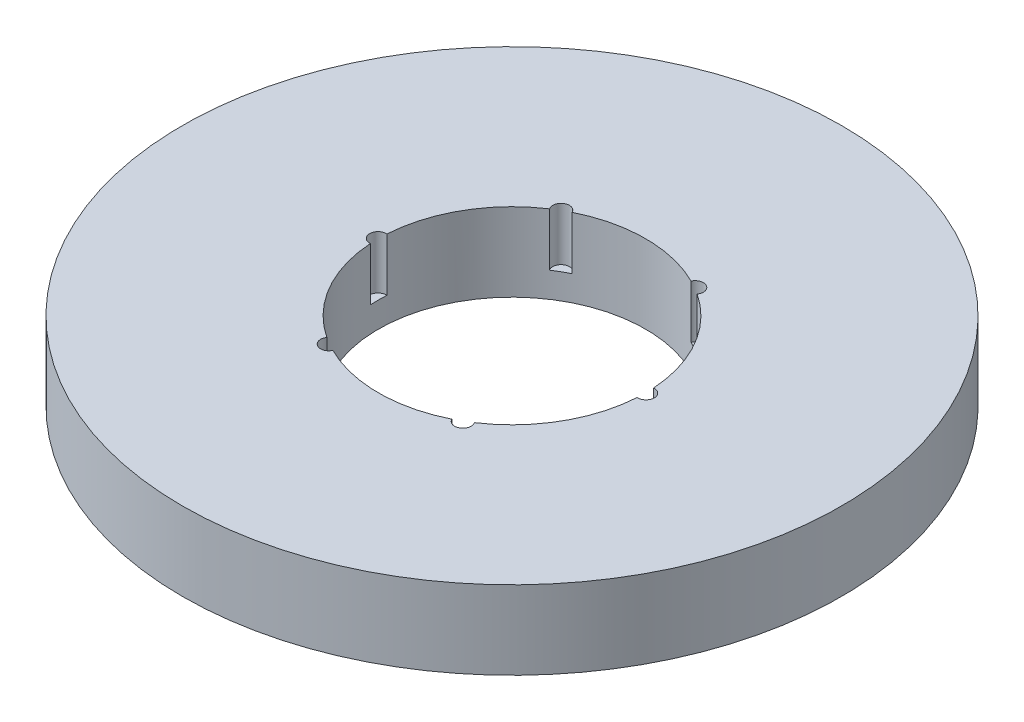
ISO-10303-21;
HEADER;
FILE_DESCRIPTION(('STEP AP214'),'2;1');
FILE_NAME('part.step','',(''),(''),'','','');
FILE_SCHEMA(('AUTOMOTIVE_DESIGN { 1 0 10303 214 1 1 1 1 }'));
ENDSEC;
DATA;
#1=APPLICATION_CONTEXT('core data for automotive mechanical design processes');
#2=APPLICATION_PROTOCOL_DEFINITION('international standard','automotive_design',2000,#1);
#3=PRODUCT_CONTEXT('',#1,'mechanical');
#4=PRODUCT('Part','Part','',(#3));
#5=PRODUCT_RELATED_PRODUCT_CATEGORY('part','',(#4));
#6=PRODUCT_DEFINITION_FORMATION('','',#4);
#7=PRODUCT_DEFINITION_CONTEXT('part definition',#1,'design');
#8=PRODUCT_DEFINITION('design','',#6,#7);
#9=PRODUCT_DEFINITION_SHAPE('','',#8);
#10=(LENGTH_UNIT() NAMED_UNIT(*) SI_UNIT(.MILLI.,.METRE.));
#11=(NAMED_UNIT(*) PLANE_ANGLE_UNIT() SI_UNIT($,.RADIAN.));
#12=(NAMED_UNIT(*) SI_UNIT($,.STERADIAN.) SOLID_ANGLE_UNIT());
#13=UNCERTAINTY_MEASURE_WITH_UNIT(LENGTH_MEASURE(1.E-05),#10,'distance_accuracy_value','');
#14=(GEOMETRIC_REPRESENTATION_CONTEXT(3) GLOBAL_UNCERTAINTY_ASSIGNED_CONTEXT((#13)) GLOBAL_UNIT_ASSIGNED_CONTEXT((#10,
#11,#12)) REPRESENTATION_CONTEXT('',''));
#15=CARTESIAN_POINT('',(0.,0.,0.));
#16=DIRECTION('',(0.,0.,1.));
#17=DIRECTION('',(1.,0.,0.));
#18=AXIS2_PLACEMENT_3D('',#15,#16,#17);
#19=CARTESIAN_POINT('',(0.,22.,0.));
#20=DIRECTION('',(0.,-1.,0.));
#21=DIRECTION('',(0.,0.,-1.));
#22=AXIS2_PLACEMENT_3D('',#19,#20,#21);
#23=CYLINDRICAL_SURFACE('',#22,92.5);
#24=CARTESIAN_POINT('',(0.,22.,0.));
#25=DIRECTION('',(0.,1.,0.));
#26=DIRECTION('',(0.,0.,1.));
#27=AXIS2_PLACEMENT_3D('',#24,#25,#26);
#28=CIRCLE('',#27,92.5);
#29=CARTESIAN_POINT('',(0.,22.,92.5));
#30=VERTEX_POINT('',#29);
#31=EDGE_CURVE('E171',#30,#30,#28,.T.);
#32=ORIENTED_EDGE('',*,*,#31,.F.);
#33=EDGE_LOOP('',(#32));
#34=FACE_BOUND('',#33,.T.);
#35=CARTESIAN_POINT('',(0.,0.,0.));
#36=DIRECTION('',(0.,1.,0.));
#37=DIRECTION('',(0.,0.,1.));
#38=AXIS2_PLACEMENT_3D('',#35,#36,#37);
#39=CIRCLE('',#38,92.5);
#40=CARTESIAN_POINT('',(0.,0.,92.5));
#41=VERTEX_POINT('',#40);
#42=EDGE_CURVE('E157',#41,#41,#39,.T.);
#43=ORIENTED_EDGE('',*,*,#42,.T.);
#44=EDGE_LOOP('',(#43));
#45=FACE_BOUND('',#44,.T.);
#46=ADVANCED_FACE('F39',(#34,#45),#23,.T.);
#47=CARTESIAN_POINT('',(0.,22.,0.));
#48=DIRECTION('',(0.,1.,0.));
#49=DIRECTION('',(0.,0.,1.));
#50=AXIS2_PLACEMENT_3D('',#47,#48,#49);
#51=PLANE('',#50);
#52=CARTESIAN_POINT('',(-18.8048842403725,22.,-32.5710149347755));
#53=DIRECTION('',(0.,1.,0.));
#54=DIRECTION('',(-0.866025403784433,0.,0.50000000000001));
#55=AXIS2_PLACEMENT_3D('',#52,#53,#54);
#56=CIRCLE('',#55,2.32921011253287);
#57=CARTESIAN_POINT('',(-16.7030116719781,22.,-33.5746839312861));
#58=VERTEX_POINT('',#57);
#59=CARTESIAN_POINT('',(-20.7250233725387,22.,-31.2525743932836));
#60=VERTEX_POINT('',#59);
#61=EDGE_CURVE('E214',#58,#60,#56,.T.);
#62=ORIENTED_EDGE('',*,*,#61,.F.);
#63=CARTESIAN_POINT('',(0.,22.,0.));
#64=DIRECTION('',(0.,1.,0.));
#65=DIRECTION('',(0.,0.,1.));
#66=AXIS2_PLACEMENT_3D('',#63,#64,#65);
#67=CIRCLE('',#66,37.5);
#68=CARTESIAN_POINT('',(16.7030116719774,22.,-33.5746839312865));
#69=VERTEX_POINT('',#68);
#70=EDGE_CURVE('E272',#69,#58,#67,.T.);
#71=ORIENTED_EDGE('',*,*,#70,.F.);
#72=CARTESIAN_POINT('',(18.8048842403718,22.,-32.5710149347759));
#73=DIRECTION('',(0.,1.,0.));
#74=DIRECTION('',(-0.866025403784443,0.,-0.499999999999992));
#75=AXIS2_PLACEMENT_3D('',#72,#73,#74);
#76=CIRCLE('',#75,2.32921011253287);
#77=CARTESIAN_POINT('',(20.725023372538,22.,-31.252574393284));
#78=VERTEX_POINT('',#77);
#79=EDGE_CURVE('E285',#78,#69,#76,.T.);
#80=ORIENTED_EDGE('',*,*,#79,.F.);
#81=CARTESIAN_POINT('',(37.428035044516,22.,-2.32210953800248));
#82=VERTEX_POINT('',#81);
#83=EDGE_CURVE('E165',#82,#78,#67,.T.);
#84=ORIENTED_EDGE('',*,*,#83,.F.);
#85=CARTESIAN_POINT('',(37.6097684807442,22.,0.));
#86=DIRECTION('',(0.,1.,0.));
#87=DIRECTION('',(0.,0.,-1.));
#88=AXIS2_PLACEMENT_3D('',#85,#86,#87);
#89=CIRCLE('',#88,2.32921011253287);
#90=CARTESIAN_POINT('',(37.428035044516,22.,2.32210953800248));
#91=VERTEX_POINT('',#90);
#92=EDGE_CURVE('E281',#91,#82,#89,.T.);
#93=ORIENTED_EDGE('',*,*,#92,.F.);
#94=CARTESIAN_POINT('',(20.7250233725384,22.,31.2525743932838));
#95=VERTEX_POINT('',#94);
#96=EDGE_CURVE('E160',#95,#91,#67,.T.);
#97=ORIENTED_EDGE('',*,*,#96,.F.);
#98=CARTESIAN_POINT('',(18.8048842403722,22.,32.5710149347756));
#99=DIRECTION('',(0.,1.,0.));
#100=DIRECTION('',(0.866025403784436,0.,-0.500000000000004));
#101=AXIS2_PLACEMENT_3D('',#98,#99,#100);
#102=CIRCLE('',#101,2.32921011253287);
#103=CARTESIAN_POINT('',(16.7030116719779,22.,33.5746839312863));
#104=VERTEX_POINT('',#103);
#105=EDGE_CURVE('E154',#104,#95,#102,.T.);
#106=ORIENTED_EDGE('',*,*,#105,.F.);
#107=CARTESIAN_POINT('',(-16.7030116719776,22.,33.5746839312864));
#108=VERTEX_POINT('',#107);
#109=EDGE_CURVE('E150',#108,#104,#67,.T.);
#110=ORIENTED_EDGE('',*,*,#109,.F.);
#111=CARTESIAN_POINT('',(-18.804884240372,22.,32.5710149347758));
#112=DIRECTION('',(0.,1.,0.));
#113=DIRECTION('',(0.86602540378444,0.,0.499999999999998));
#114=AXIS2_PLACEMENT_3D('',#111,#112,#113);
#115=CIRCLE('',#114,2.32921011253287);
#116=CARTESIAN_POINT('',(-20.7250233725382,22.,31.2525743932839));
#117=VERTEX_POINT('',#116);
#118=EDGE_CURVE('E127',#117,#108,#115,.T.);
#119=ORIENTED_EDGE('',*,*,#118,.F.);
#120=CARTESIAN_POINT('',(-37.428035044516,22.,2.32210953800248));
#121=VERTEX_POINT('',#120);
#122=EDGE_CURVE('E156',#121,#117,#67,.T.);
#123=ORIENTED_EDGE('',*,*,#122,.F.);
#124=CARTESIAN_POINT('',(-37.6097684807442,22.,0.));
#125=DIRECTION('',(0.,1.,0.));
#126=DIRECTION('',(0.,0.,1.));
#127=AXIS2_PLACEMENT_3D('',#124,#125,#126);
#128=CIRCLE('',#127,2.32921011253287);
#129=CARTESIAN_POINT('',(-37.428035044516,22.,-2.32210953800248));
#130=VERTEX_POINT('',#129);
#131=EDGE_CURVE('E164',#130,#121,#128,.T.);
#132=ORIENTED_EDGE('',*,*,#131,.F.);
#133=EDGE_CURVE('E159',#60,#130,#67,.T.);
#134=ORIENTED_EDGE('',*,*,#133,.F.);
#135=EDGE_LOOP('',(#62,#71,#80,#84,#93,#97,#106,#110,#119,#123,#132,#134));
#136=FACE_BOUND('',#135,.T.);
#137=ORIENTED_EDGE('',*,*,#31,.T.);
#138=EDGE_LOOP('',(#137));
#139=FACE_BOUND('',#138,.T.);
#140=ADVANCED_FACE('F155',(#136,#139),#51,.T.);
#141=CARTESIAN_POINT('',(0.,0.,0.));
#142=DIRECTION('',(0.,1.,0.));
#143=DIRECTION('',(0.,0.,1.));
#144=AXIS2_PLACEMENT_3D('',#141,#142,#143);
#145=PLANE('',#144);
#146=CARTESIAN_POINT('',(0.,0.,0.));
#147=DIRECTION('',(0.,1.,0.));
#148=DIRECTION('',(0.,0.,1.));
#149=AXIS2_PLACEMENT_3D('',#146,#147,#148);
#150=CIRCLE('',#149,37.5);
#151=CARTESIAN_POINT('',(0.,0.,37.5));
#152=VERTEX_POINT('',#151);
#153=EDGE_CURVE('E170',#152,#152,#150,.T.);
#154=ORIENTED_EDGE('',*,*,#153,.T.);
#155=EDGE_LOOP('',(#154));
#156=FACE_BOUND('',#155,.T.);
#157=ORIENTED_EDGE('',*,*,#42,.F.);
#158=EDGE_LOOP('',(#157));
#159=FACE_BOUND('',#158,.T.);
#160=ADVANCED_FACE('F232',(#156,#159),#145,.F.);
#161=CARTESIAN_POINT('',(0.,22.,0.));
#162=DIRECTION('',(0.,-1.,0.));
#163=DIRECTION('',(0.,0.,-1.));
#164=AXIS2_PLACEMENT_3D('',#161,#162,#163);
#165=CYLINDRICAL_SURFACE('',#164,37.5);
#166=DIRECTION('',(0.,1.,0.));
#167=VECTOR('',#166,1.);
#168=CARTESIAN_POINT('',(-16.7030116719781,14.5413752247576,-33.5746839312861));
#169=LINE('',#168,#167);
#170=CARTESIAN_POINT('',(-16.7030116719781,7.08275044951523,-33.5746839312861));
#171=VERTEX_POINT('',#170);
#172=EDGE_CURVE('E11',#171,#58,#169,.T.);
#173=ORIENTED_EDGE('',*,*,#172,.F.);
#174=CARTESIAN_POINT('',(0.,7.08275044951523,0.));
#175=DIRECTION('',(0.,1.,0.));
#176=DIRECTION('',(0.,0.,1.));
#177=AXIS2_PLACEMENT_3D('',#174,#175,#176);
#178=CIRCLE('',#177,37.5);
#179=CARTESIAN_POINT('',(-20.7250233725387,7.08275044951523,-31.2525743932836));
#180=VERTEX_POINT('',#179);
#181=EDGE_CURVE('E209',#171,#180,#178,.T.);
#182=ORIENTED_EDGE('',*,*,#181,.T.);
#183=DIRECTION('',(0.,1.,0.));
#184=VECTOR('',#183,1.);
#185=CARTESIAN_POINT('',(-20.7250233725387,14.5413752247576,-31.2525743932836));
#186=LINE('',#185,#184);
#187=EDGE_CURVE('E46',#60,#180,#186,.F.);
#188=ORIENTED_EDGE('',*,*,#187,.F.);
#189=ORIENTED_EDGE('',*,*,#133,.T.);
#190=DIRECTION('',(0.,1.,0.));
#191=VECTOR('',#190,1.);
#192=CARTESIAN_POINT('',(-37.428035044516,14.5413752247576,-2.32210953800248));
#193=LINE('',#192,#191);
#194=CARTESIAN_POINT('',(-37.428035044516,7.08275044951523,-2.32210953800248));
#195=VERTEX_POINT('',#194);
#196=EDGE_CURVE('E185',#195,#130,#193,.T.);
#197=ORIENTED_EDGE('',*,*,#196,.F.);
#198=CARTESIAN_POINT('',(0.,7.08275044951523,0.));
#199=DIRECTION('',(0.,1.,0.));
#200=DIRECTION('',(0.,0.,1.));
#201=AXIS2_PLACEMENT_3D('',#198,#199,#200);
#202=CIRCLE('',#201,37.5);
#203=CARTESIAN_POINT('',(-37.428035044516,7.08275044951523,2.32210953800248));
#204=VERTEX_POINT('',#203);
#205=EDGE_CURVE('E173',#195,#204,#202,.T.);
#206=ORIENTED_EDGE('',*,*,#205,.T.);
#207=DIRECTION('',(0.,1.,0.));
#208=VECTOR('',#207,1.);
#209=CARTESIAN_POINT('',(-37.428035044516,14.5413752247576,2.32210953800248));
#210=LINE('',#209,#208);
#211=EDGE_CURVE('E178',#121,#204,#210,.F.);
#212=ORIENTED_EDGE('',*,*,#211,.F.);
#213=ORIENTED_EDGE('',*,*,#122,.T.);
#214=DIRECTION('',(0.,1.,0.));
#215=VECTOR('',#214,1.);
#216=CARTESIAN_POINT('',(-20.7250233725382,14.5413752247576,31.2525743932839));
#217=LINE('',#216,#215);
#218=CARTESIAN_POINT('',(-20.7250233725382,7.08275044951523,31.2525743932839));
#219=VERTEX_POINT('',#218);
#220=EDGE_CURVE('E132',#219,#117,#217,.T.);
#221=ORIENTED_EDGE('',*,*,#220,.F.);
#222=CARTESIAN_POINT('',(0.,7.08275044951523,0.));
#223=DIRECTION('',(0.,1.,0.));
#224=DIRECTION('',(0.,0.,1.));
#225=AXIS2_PLACEMENT_3D('',#222,#223,#224);
#226=CIRCLE('',#225,37.5);
#227=CARTESIAN_POINT('',(-16.7030116719776,7.08275044951523,33.5746839312864));
#228=VERTEX_POINT('',#227);
#229=EDGE_CURVE('E146',#219,#228,#226,.T.);
#230=ORIENTED_EDGE('',*,*,#229,.T.);
#231=DIRECTION('',(0.,1.,0.));
#232=VECTOR('',#231,1.);
#233=CARTESIAN_POINT('',(-16.7030116719776,14.5413752247576,33.5746839312864));
#234=LINE('',#233,#232);
#235=EDGE_CURVE('E128',#108,#228,#234,.F.);
#236=ORIENTED_EDGE('',*,*,#235,.F.);
#237=ORIENTED_EDGE('',*,*,#109,.T.);
#238=DIRECTION('',(0.,1.,0.));
#239=VECTOR('',#238,1.);
#240=CARTESIAN_POINT('',(16.7030116719779,14.5413752247576,33.5746839312863));
#241=LINE('',#240,#239);
#242=CARTESIAN_POINT('',(16.7030116719779,7.08275044951523,33.5746839312863));
#243=VERTEX_POINT('',#242);
#244=EDGE_CURVE('E192',#243,#104,#241,.T.);
#245=ORIENTED_EDGE('',*,*,#244,.F.);
#246=CARTESIAN_POINT('',(0.,7.08275044951523,0.));
#247=DIRECTION('',(0.,1.,0.));
#248=DIRECTION('',(0.,0.,1.));
#249=AXIS2_PLACEMENT_3D('',#246,#247,#248);
#250=CIRCLE('',#249,37.5);
#251=CARTESIAN_POINT('',(20.7250233725384,7.08275044951523,31.2525743932838));
#252=VERTEX_POINT('',#251);
#253=EDGE_CURVE('E190',#243,#252,#250,.T.);
#254=ORIENTED_EDGE('',*,*,#253,.T.);
#255=DIRECTION('',(0.,1.,0.));
#256=VECTOR('',#255,1.);
#257=CARTESIAN_POINT('',(20.7250233725384,14.5413752247576,31.2525743932838));
#258=LINE('',#257,#256);
#259=EDGE_CURVE('E189',#95,#252,#258,.F.);
#260=ORIENTED_EDGE('',*,*,#259,.F.);
#261=ORIENTED_EDGE('',*,*,#96,.T.);
#262=DIRECTION('',(0.,1.,0.));
#263=VECTOR('',#262,1.);
#264=CARTESIAN_POINT('',(37.428035044516,14.5413752247576,2.32210953800248));
#265=LINE('',#264,#263);
#266=CARTESIAN_POINT('',(37.428035044516,7.08275044951523,2.32210953800248));
#267=VERTEX_POINT('',#266);
#268=EDGE_CURVE('E203',#267,#91,#265,.T.);
#269=ORIENTED_EDGE('',*,*,#268,.F.);
#270=CARTESIAN_POINT('',(0.,7.08275044951523,0.));
#271=DIRECTION('',(0.,1.,0.));
#272=DIRECTION('',(0.,0.,1.));
#273=AXIS2_PLACEMENT_3D('',#270,#271,#272);
#274=CIRCLE('',#273,37.5);
#275=CARTESIAN_POINT('',(37.428035044516,7.08275044951523,-2.32210953800248));
#276=VERTEX_POINT('',#275);
#277=EDGE_CURVE('E194',#267,#276,#274,.T.);
#278=ORIENTED_EDGE('',*,*,#277,.T.);
#279=DIRECTION('',(0.,1.,0.));
#280=VECTOR('',#279,1.);
#281=CARTESIAN_POINT('',(37.428035044516,14.5413752247576,-2.32210953800248));
#282=LINE('',#281,#280);
#283=EDGE_CURVE('E196',#82,#276,#282,.F.);
#284=ORIENTED_EDGE('',*,*,#283,.F.);
#285=ORIENTED_EDGE('',*,*,#83,.T.);
#286=DIRECTION('',(0.,1.,0.));
#287=VECTOR('',#286,1.);
#288=CARTESIAN_POINT('',(20.725023372538,14.5413752247576,-31.252574393284));
#289=LINE('',#288,#287);
#290=CARTESIAN_POINT('',(20.725023372538,7.08275044951523,-31.252574393284));
#291=VERTEX_POINT('',#290);
#292=EDGE_CURVE('E208',#291,#78,#289,.T.);
#293=ORIENTED_EDGE('',*,*,#292,.F.);
#294=CARTESIAN_POINT('',(0.,7.08275044951523,0.));
#295=DIRECTION('',(0.,1.,0.));
#296=DIRECTION('',(0.,0.,1.));
#297=AXIS2_PLACEMENT_3D('',#294,#295,#296);
#298=CIRCLE('',#297,37.5);
#299=CARTESIAN_POINT('',(16.7030116719774,7.08275044951523,-33.5746839312865));
#300=VERTEX_POINT('',#299);
#301=EDGE_CURVE('E201',#291,#300,#298,.T.);
#302=ORIENTED_EDGE('',*,*,#301,.T.);
#303=DIRECTION('',(0.,1.,0.));
#304=VECTOR('',#303,1.);
#305=CARTESIAN_POINT('',(16.7030116719774,14.5413752247576,-33.5746839312865));
#306=LINE('',#305,#304);
#307=EDGE_CURVE('E206',#69,#300,#306,.F.);
#308=ORIENTED_EDGE('',*,*,#307,.F.);
#309=ORIENTED_EDGE('',*,*,#70,.T.);
#310=EDGE_LOOP('',(#173,#182,#188,#189,#197,#206,#212,#213,#221,#230,#236,#237,#245,#254,#260,
#261,#269,#278,#284,#285,#293,#302,#308,#309));
#311=FACE_BOUND('',#310,.T.);
#312=ORIENTED_EDGE('',*,*,#153,.F.);
#313=EDGE_LOOP('',(#312));
#314=FACE_BOUND('',#313,.T.);
#315=ADVANCED_FACE('F145',(#311,#314),#165,.F.);
#316=CARTESIAN_POINT('',(-37.6097684807442,7.08275044951523,0.));
#317=DIRECTION('',(0.,1.,0.));
#318=DIRECTION('',(0.,0.,1.));
#319=AXIS2_PLACEMENT_3D('',#316,#317,#318);
#320=CYLINDRICAL_SURFACE('',#319,2.32921011253287);
#321=ORIENTED_EDGE('',*,*,#196,.T.);
#322=ORIENTED_EDGE('',*,*,#131,.T.);
#323=ORIENTED_EDGE('',*,*,#211,.T.);
#324=CARTESIAN_POINT('',(-37.6097684807442,7.08275044951523,0.));
#325=DIRECTION('',(0.,1.,0.));
#326=DIRECTION('',(0.,0.,1.));
#327=AXIS2_PLACEMENT_3D('',#324,#325,#326);
#328=CIRCLE('',#327,2.32921011253287);
#329=EDGE_CURVE('E168',#195,#204,#328,.T.);
#330=ORIENTED_EDGE('',*,*,#329,.F.);
#331=EDGE_LOOP('',(#321,#322,#323,#330));
#332=FACE_BOUND('',#331,.T.);
#333=ADVANCED_FACE('F243',(#332),#320,.F.);
#334=CARTESIAN_POINT('',(-37.6097684807442,7.08275044951523,0.));
#335=DIRECTION('',(0.,1.,0.));
#336=DIRECTION('',(0.,0.,1.));
#337=AXIS2_PLACEMENT_3D('',#334,#335,#336);
#338=PLANE('',#337);
#339=ORIENTED_EDGE('',*,*,#329,.T.);
#340=ORIENTED_EDGE('',*,*,#205,.F.);
#341=EDGE_LOOP('',(#339,#340));
#342=FACE_BOUND('',#341,.T.);
#343=ADVANCED_FACE('F247',(#342),#338,.T.);
#344=CARTESIAN_POINT('',(-18.804884240372,7.08275044951523,32.5710149347758));
#345=DIRECTION('',(0.,1.,0.));
#346=DIRECTION('',(0.,0.,1.));
#347=AXIS2_PLACEMENT_3D('',#344,#345,#346);
#348=CYLINDRICAL_SURFACE('',#347,2.32921011253287);
#349=ORIENTED_EDGE('',*,*,#220,.T.);
#350=ORIENTED_EDGE('',*,*,#118,.T.);
#351=ORIENTED_EDGE('',*,*,#235,.T.);
#352=CARTESIAN_POINT('',(-18.804884240372,7.08275044951523,32.5710149347758));
#353=DIRECTION('',(0.,1.,0.));
#354=DIRECTION('',(0.86602540378444,0.,0.499999999999998));
#355=AXIS2_PLACEMENT_3D('',#352,#353,#354);
#356=CIRCLE('',#355,2.32921011253287);
#357=EDGE_CURVE('E137',#219,#228,#356,.T.);
#358=ORIENTED_EDGE('',*,*,#357,.F.);
#359=EDGE_LOOP('',(#349,#350,#351,#358));
#360=FACE_BOUND('',#359,.T.);
#361=ADVANCED_FACE('F126',(#360),#348,.F.);
#362=CARTESIAN_POINT('',(-18.804884240372,7.08275044951523,32.5710149347758));
#363=DIRECTION('',(0.,1.,0.));
#364=DIRECTION('',(0.86602540378444,0.,0.499999999999998));
#365=AXIS2_PLACEMENT_3D('',#362,#363,#364);
#366=PLANE('',#365);
#367=ORIENTED_EDGE('',*,*,#357,.T.);
#368=ORIENTED_EDGE('',*,*,#229,.F.);
#369=EDGE_LOOP('',(#367,#368));
#370=FACE_BOUND('',#369,.T.);
#371=ADVANCED_FACE('F254',(#370),#366,.T.);
#372=CARTESIAN_POINT('',(18.8048842403722,7.08275044951523,32.5710149347756));
#373=DIRECTION('',(0.,1.,0.));
#374=DIRECTION('',(0.,0.,1.));
#375=AXIS2_PLACEMENT_3D('',#372,#373,#374);
#376=CYLINDRICAL_SURFACE('',#375,2.32921011253287);
#377=ORIENTED_EDGE('',*,*,#244,.T.);
#378=ORIENTED_EDGE('',*,*,#105,.T.);
#379=ORIENTED_EDGE('',*,*,#259,.T.);
#380=CARTESIAN_POINT('',(18.8048842403722,7.08275044951523,32.5710149347756));
#381=DIRECTION('',(0.,1.,0.));
#382=DIRECTION('',(0.866025403784436,0.,-0.500000000000004));
#383=AXIS2_PLACEMENT_3D('',#380,#381,#382);
#384=CIRCLE('',#383,2.32921011253287);
#385=EDGE_CURVE('E138',#243,#252,#384,.T.);
#386=ORIENTED_EDGE('',*,*,#385,.F.);
#387=EDGE_LOOP('',(#377,#378,#379,#386));
#388=FACE_BOUND('',#387,.T.);
#389=ADVANCED_FACE('F260',(#388),#376,.F.);
#390=CARTESIAN_POINT('',(18.8048842403722,7.08275044951523,32.5710149347756));
#391=DIRECTION('',(0.,1.,0.));
#392=DIRECTION('',(0.866025403784436,0.,-0.500000000000004));
#393=AXIS2_PLACEMENT_3D('',#390,#391,#392);
#394=PLANE('',#393);
#395=ORIENTED_EDGE('',*,*,#385,.T.);
#396=ORIENTED_EDGE('',*,*,#253,.F.);
#397=EDGE_LOOP('',(#395,#396));
#398=FACE_BOUND('',#397,.T.);
#399=ADVANCED_FACE('F265',(#398),#394,.T.);
#400=CARTESIAN_POINT('',(37.6097684807442,7.08275044951523,0.));
#401=DIRECTION('',(0.,1.,0.));
#402=DIRECTION('',(0.,0.,1.));
#403=AXIS2_PLACEMENT_3D('',#400,#401,#402);
#404=CYLINDRICAL_SURFACE('',#403,2.32921011253287);
#405=ORIENTED_EDGE('',*,*,#268,.T.);
#406=ORIENTED_EDGE('',*,*,#92,.T.);
#407=ORIENTED_EDGE('',*,*,#283,.T.);
#408=CARTESIAN_POINT('',(37.6097684807442,7.08275044951523,0.));
#409=DIRECTION('',(0.,1.,0.));
#410=DIRECTION('',(0.,0.,-1.));
#411=AXIS2_PLACEMENT_3D('',#408,#409,#410);
#412=CIRCLE('',#411,2.32921011253287);
#413=EDGE_CURVE('E287',#267,#276,#412,.T.);
#414=ORIENTED_EDGE('',*,*,#413,.F.);
#415=EDGE_LOOP('',(#405,#406,#407,#414));
#416=FACE_BOUND('',#415,.T.);
#417=ADVANCED_FACE('F300',(#416),#404,.F.);
#418=CARTESIAN_POINT('',(37.6097684807442,7.08275044951523,0.));
#419=DIRECTION('',(0.,1.,0.));
#420=DIRECTION('',(0.,0.,-1.));
#421=AXIS2_PLACEMENT_3D('',#418,#419,#420);
#422=PLANE('',#421);
#423=ORIENTED_EDGE('',*,*,#413,.T.);
#424=ORIENTED_EDGE('',*,*,#277,.F.);
#425=EDGE_LOOP('',(#423,#424));
#426=FACE_BOUND('',#425,.T.);
#427=ADVANCED_FACE('F298',(#426),#422,.T.);
#428=CARTESIAN_POINT('',(18.8048842403718,7.08275044951523,-32.5710149347759));
#429=DIRECTION('',(0.,1.,0.));
#430=DIRECTION('',(0.,0.,1.));
#431=AXIS2_PLACEMENT_3D('',#428,#429,#430);
#432=CYLINDRICAL_SURFACE('',#431,2.32921011253287);
#433=ORIENTED_EDGE('',*,*,#292,.T.);
#434=ORIENTED_EDGE('',*,*,#79,.T.);
#435=ORIENTED_EDGE('',*,*,#307,.T.);
#436=CARTESIAN_POINT('',(18.8048842403718,7.08275044951523,-32.5710149347759));
#437=DIRECTION('',(0.,1.,0.));
#438=DIRECTION('',(-0.866025403784443,0.,-0.499999999999992));
#439=AXIS2_PLACEMENT_3D('',#436,#437,#438);
#440=CIRCLE('',#439,2.32921011253287);
#441=EDGE_CURVE('E56',#291,#300,#440,.T.);
#442=ORIENTED_EDGE('',*,*,#441,.F.);
#443=EDGE_LOOP('',(#433,#434,#435,#442));
#444=FACE_BOUND('',#443,.T.);
#445=ADVANCED_FACE('F301',(#444),#432,.F.);
#446=CARTESIAN_POINT('',(18.8048842403718,7.08275044951523,-32.5710149347759));
#447=DIRECTION('',(0.,1.,0.));
#448=DIRECTION('',(-0.866025403784443,0.,-0.499999999999992));
#449=AXIS2_PLACEMENT_3D('',#446,#447,#448);
#450=PLANE('',#449);
#451=ORIENTED_EDGE('',*,*,#441,.T.);
#452=ORIENTED_EDGE('',*,*,#301,.F.);
#453=EDGE_LOOP('',(#451,#452));
#454=FACE_BOUND('',#453,.T.);
#455=ADVANCED_FACE('F221',(#454),#450,.T.);
#456=CARTESIAN_POINT('',(-18.8048842403725,7.08275044951523,-32.5710149347755));
#457=DIRECTION('',(0.,1.,0.));
#458=DIRECTION('',(0.,0.,1.));
#459=AXIS2_PLACEMENT_3D('',#456,#457,#458);
#460=CYLINDRICAL_SURFACE('',#459,2.32921011253287);
#461=ORIENTED_EDGE('',*,*,#172,.T.);
#462=ORIENTED_EDGE('',*,*,#61,.T.);
#463=ORIENTED_EDGE('',*,*,#187,.T.);
#464=CARTESIAN_POINT('',(-18.8048842403725,7.08275044951523,-32.5710149347755));
#465=DIRECTION('',(0.,1.,0.));
#466=DIRECTION('',(-0.866025403784433,0.,0.50000000000001));
#467=AXIS2_PLACEMENT_3D('',#464,#465,#466);
#468=CIRCLE('',#467,2.32921011253287);
#469=EDGE_CURVE('E55',#171,#180,#468,.T.);
#470=ORIENTED_EDGE('',*,*,#469,.F.);
#471=EDGE_LOOP('',(#461,#462,#463,#470));
#472=FACE_BOUND('',#471,.T.);
#473=ADVANCED_FACE('F212',(#472),#460,.F.);
#474=CARTESIAN_POINT('',(-18.8048842403725,7.08275044951523,-32.5710149347755));
#475=DIRECTION('',(0.,1.,0.));
#476=DIRECTION('',(-0.866025403784433,0.,0.50000000000001));
#477=AXIS2_PLACEMENT_3D('',#474,#475,#476);
#478=PLANE('',#477);
#479=ORIENTED_EDGE('',*,*,#469,.T.);
#480=ORIENTED_EDGE('',*,*,#181,.F.);
#481=EDGE_LOOP('',(#479,#480));
#482=FACE_BOUND('',#481,.T.);
#483=ADVANCED_FACE('F217',(#482),#478,.T.);
#484=CLOSED_SHELL('',(#46,#140,#160,#315,#333,#343,#361,#371,#389,#399,#417,#427,#445,#455,#473,#483));
#485=MANIFOLD_SOLID_BREP('B2',#484);
#486=ADVANCED_BREP_SHAPE_REPRESENTATION('',(#18,#485),#14);
#487=SHAPE_DEFINITION_REPRESENTATION(#9,#486);
ENDSEC;
END-ISO-10303-21;
